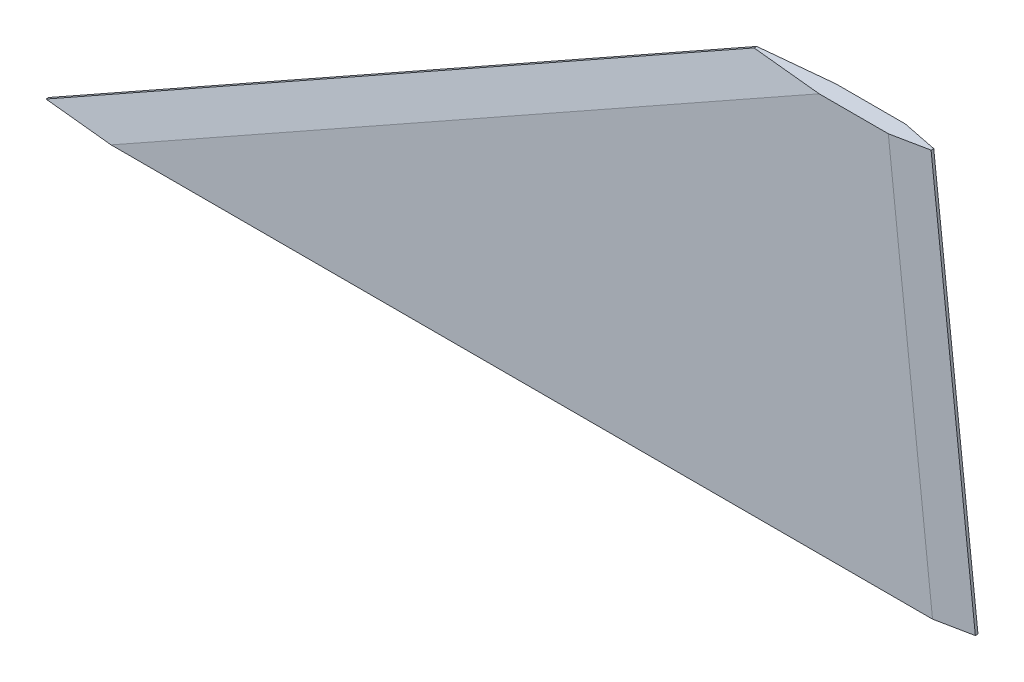
ISO-10303-21;
HEADER;
FILE_DESCRIPTION(('STEP AP214'),'2;1');
FILE_NAME('part.step','',(''),(''),'','','');
FILE_SCHEMA(('AUTOMOTIVE_DESIGN { 1 0 10303 214 1 1 1 1 }'));
ENDSEC;
DATA;
#1=APPLICATION_CONTEXT('core data for automotive mechanical design processes');
#2=APPLICATION_PROTOCOL_DEFINITION('international standard','automotive_design',2000,#1);
#3=PRODUCT_CONTEXT('',#1,'mechanical');
#4=PRODUCT('Part','Part','',(#3));
#5=PRODUCT_RELATED_PRODUCT_CATEGORY('part','',(#4));
#6=PRODUCT_DEFINITION_FORMATION('','',#4);
#7=PRODUCT_DEFINITION_CONTEXT('part definition',#1,'design');
#8=PRODUCT_DEFINITION('design','',#6,#7);
#9=PRODUCT_DEFINITION_SHAPE('','',#8);
#10=(LENGTH_UNIT() NAMED_UNIT(*) SI_UNIT(.MILLI.,.METRE.));
#11=(NAMED_UNIT(*) PLANE_ANGLE_UNIT() SI_UNIT($,.RADIAN.));
#12=(NAMED_UNIT(*) SI_UNIT($,.STERADIAN.) SOLID_ANGLE_UNIT());
#13=UNCERTAINTY_MEASURE_WITH_UNIT(LENGTH_MEASURE(1.E-05),#10,'distance_accuracy_value','');
#14=(GEOMETRIC_REPRESENTATION_CONTEXT(3) GLOBAL_UNCERTAINTY_ASSIGNED_CONTEXT((#13)) GLOBAL_UNIT_ASSIGNED_CONTEXT((#10,
#11,#12)) REPRESENTATION_CONTEXT('',''));
#15=CARTESIAN_POINT('',(0.,0.,0.));
#16=DIRECTION('',(0.,0.,1.));
#17=DIRECTION('',(1.,0.,0.));
#18=AXIS2_PLACEMENT_3D('',#15,#16,#17);
#19=CARTESIAN_POINT('',(133.35,0.,1.2192));
#20=DIRECTION('',(0.,1.,0.));
#21=DIRECTION('',(0.,0.,1.));
#22=AXIS2_PLACEMENT_3D('',#19,#20,#21);
#23=PLANE('',#22);
#24=DIRECTION('',(0.,0.,-1.));
#25=VECTOR('',#24,1.);
#26=CARTESIAN_POINT('',(133.35,0.,1.2192));
#27=LINE('',#26,#25);
#28=CARTESIAN_POINT('',(133.35,0.,0.190499999999965));
#29=VERTEX_POINT('',#28);
#30=CARTESIAN_POINT('',(133.35,0.,-0.190499999999997));
#31=VERTEX_POINT('',#30);
#32=EDGE_CURVE('E130',#29,#31,#27,.T.);
#33=ORIENTED_EDGE('',*,*,#32,.F.);
#34=DIRECTION('',(-0.98034213572889,0.,0.197305085881025));
#35=VECTOR('',#34,1.);
#36=CARTESIAN_POINT('',(126.735732139005,0.,1.5216971818731));
#37=LINE('',#36,#35);
#38=CARTESIAN_POINT('',(128.238738166474,0.,1.2192));
#39=VERTEX_POINT('',#38);
#40=EDGE_CURVE('E51',#29,#39,#37,.T.);
#41=ORIENTED_EDGE('',*,*,#40,.T.);
#42=DIRECTION('',(1.,0.,0.));
#43=VECTOR('',#42,1.);
#44=CARTESIAN_POINT('',(133.35,0.,1.2192));
#45=LINE('',#44,#43);
#46=CARTESIAN_POINT('',(10.3618226148316,0.,1.2192));
#47=VERTEX_POINT('',#46);
#48=EDGE_CURVE('E125',#47,#39,#45,.T.);
#49=ORIENTED_EDGE('',*,*,#48,.F.);
#50=DIRECTION('',(-0.995108081066188,0.,-0.0987922415818602));
#51=VECTOR('',#50,1.);
#52=CARTESIAN_POINT('',(2.56735020952827,0.,0.445381139999556));
#53=LINE('',#52,#51);
#54=CARTESIAN_POINT('',(0.,0.,0.190499999999964));
#55=VERTEX_POINT('',#54);
#56=EDGE_CURVE('E109',#47,#55,#53,.T.);
#57=ORIENTED_EDGE('',*,*,#56,.T.);
#58=DIRECTION('',(0.,0.,-1.));
#59=VECTOR('',#58,1.);
#60=CARTESIAN_POINT('',(0.,0.,1.2192));
#61=LINE('',#60,#59);
#62=CARTESIAN_POINT('',(0.,0.,-0.190500000000007));
#63=VERTEX_POINT('',#62);
#64=EDGE_CURVE('E135',#55,#63,#61,.T.);
#65=ORIENTED_EDGE('',*,*,#64,.T.);
#66=DIRECTION('',(-0.995108081066189,0.,0.0987922415818555));
#67=VECTOR('',#66,1.);
#68=CARTESIAN_POINT('',(0.,0.,-0.190500000000007));
#69=LINE('',#68,#67);
#70=CARTESIAN_POINT('',(10.3618226148317,0.,-1.2192));
#71=VERTEX_POINT('',#70);
#72=EDGE_CURVE('E119',#63,#71,#69,.F.);
#73=ORIENTED_EDGE('',*,*,#72,.T.);
#74=DIRECTION('',(1.,0.,0.));
#75=VECTOR('',#74,1.);
#76=CARTESIAN_POINT('',(133.35,0.,-1.2192));
#77=LINE('',#76,#75);
#78=CARTESIAN_POINT('',(128.238738166473,0.,-1.2192));
#79=VERTEX_POINT('',#78);
#80=EDGE_CURVE('E137',#71,#79,#77,.T.);
#81=ORIENTED_EDGE('',*,*,#80,.T.);
#82=DIRECTION('',(-0.980342135728892,0.,-0.197305085881014));
#83=VECTOR('',#82,1.);
#84=CARTESIAN_POINT('',(127.247201035407,0.,-1.41875820694556));
#85=LINE('',#84,#83);
#86=EDGE_CURVE('E63',#79,#31,#85,.F.);
#87=ORIENTED_EDGE('',*,*,#86,.T.);
#88=EDGE_LOOP('',(#33,#41,#49,#57,#65,#73,#81,#87));
#89=FACE_BOUND('',#88,.T.);
#90=ADVANCED_FACE('F42',(#89),#23,.F.);
#91=CARTESIAN_POINT('',(127.,57.15,1.2192));
#92=DIRECTION('',(-0.993883734673619,-0.110431526074846,0.));
#93=DIRECTION('',(0.110431526074846,-0.993883734673619,0.));
#94=AXIS2_PLACEMENT_3D('',#91,#92,#93);
#95=PLANE('',#94);
#96=DIRECTION('',(0.,0.,-1.));
#97=VECTOR('',#96,1.);
#98=CARTESIAN_POINT('',(127.,57.15,1.2192));
#99=LINE('',#98,#97);
#100=CARTESIAN_POINT('',(127.,57.15,0.190499999999965));
#101=VERTEX_POINT('',#100);
#102=CARTESIAN_POINT('',(127.,57.15,-0.190499999999997));
#103=VERTEX_POINT('',#102);
#104=EDGE_CURVE('E145',#101,#103,#99,.T.);
#105=ORIENTED_EDGE('',*,*,#104,.F.);
#106=DIRECTION('',(0.110431526074846,-0.993883734673619,0.));
#107=VECTOR('',#106,1.);
#108=CARTESIAN_POINT('',(133.35,0.,0.190499999999965));
#109=LINE('',#108,#107);
#110=EDGE_CURVE('E169',#101,#29,#109,.T.);
#111=ORIENTED_EDGE('',*,*,#110,.T.);
#112=ORIENTED_EDGE('',*,*,#32,.T.);
#113=DIRECTION('',(-0.110431526074846,0.993883734673619,0.));
#114=VECTOR('',#113,1.);
#115=CARTESIAN_POINT('',(127.,57.15,-0.190499999999997));
#116=LINE('',#115,#114);
#117=EDGE_CURVE('E166',#31,#103,#116,.T.);
#118=ORIENTED_EDGE('',*,*,#117,.T.);
#119=EDGE_LOOP('',(#105,#111,#112,#118));
#120=FACE_BOUND('',#119,.T.);
#121=ADVANCED_FACE('F174',(#120),#95,.F.);
#122=CARTESIAN_POINT('',(101.6,57.15,1.2192));
#123=DIRECTION('',(0.,-1.,0.));
#124=DIRECTION('',(0.,0.,-1.));
#125=AXIS2_PLACEMENT_3D('',#122,#123,#124);
#126=PLANE('',#125);
#127=DIRECTION('',(-1.,0.,0.));
#128=VECTOR('',#127,1.);
#129=CARTESIAN_POINT('',(101.6,57.15,1.2192));
#130=LINE('',#129,#128);
#131=CARTESIAN_POINT('',(121.888738166474,57.15,1.2192));
#132=VERTEX_POINT('',#131);
#133=CARTESIAN_POINT('',(111.961822614832,57.15,1.2192));
#134=VERTEX_POINT('',#133);
#135=EDGE_CURVE('E128',#132,#134,#130,.T.);
#136=ORIENTED_EDGE('',*,*,#135,.F.);
#137=DIRECTION('',(0.98034213572889,0.,-0.197305085881025));
#138=VECTOR('',#137,1.);
#139=CARTESIAN_POINT('',(126.488531103597,57.15,0.293438974927473));
#140=LINE('',#139,#138);
#141=EDGE_CURVE('E164',#132,#101,#140,.T.);
#142=ORIENTED_EDGE('',*,*,#141,.T.);
#143=ORIENTED_EDGE('',*,*,#104,.T.);
#144=DIRECTION('',(0.980342135728892,0.,0.197305085881014));
#145=VECTOR('',#144,1.);
#146=CARTESIAN_POINT('',(127.,57.15,-0.190499999999997));
#147=LINE('',#146,#145);
#148=CARTESIAN_POINT('',(121.888738166473,57.15,-1.2192));
#149=VERTEX_POINT('',#148);
#150=EDGE_CURVE('E162',#103,#149,#147,.F.);
#151=ORIENTED_EDGE('',*,*,#150,.T.);
#152=DIRECTION('',(-1.,0.,0.));
#153=VECTOR('',#152,1.);
#154=CARTESIAN_POINT('',(101.6,57.15,-1.2192));
#155=LINE('',#154,#153);
#156=CARTESIAN_POINT('',(111.961822614832,57.15,-1.2192));
#157=VERTEX_POINT('',#156);
#158=EDGE_CURVE('E133',#149,#157,#155,.T.);
#159=ORIENTED_EDGE('',*,*,#158,.T.);
#160=DIRECTION('',(0.995108081066189,0.,-0.0987922415818555));
#161=VECTOR('',#160,1.);
#162=CARTESIAN_POINT('',(0.991606550871599,57.15,9.79769012718635));
#163=LINE('',#162,#161);
#164=CARTESIAN_POINT('',(101.6,57.15,-0.190500000000007));
#165=VERTEX_POINT('',#164);
#166=EDGE_CURVE('E153',#157,#165,#163,.F.);
#167=ORIENTED_EDGE('',*,*,#166,.T.);
#168=DIRECTION('',(0.,0.,-1.));
#169=VECTOR('',#168,1.);
#170=CARTESIAN_POINT('',(101.6,57.15,1.2192));
#171=LINE('',#170,#169);
#172=CARTESIAN_POINT('',(101.6,57.15,0.190499999999964));
#173=VERTEX_POINT('',#172);
#174=EDGE_CURVE('E142',#173,#165,#171,.T.);
#175=ORIENTED_EDGE('',*,*,#174,.F.);
#176=DIRECTION('',(0.995108081066188,0.,0.0987922415818602));
#177=VECTOR('',#176,1.);
#178=CARTESIAN_POINT('',(3.55895676039996,57.15,-9.54280898718727));
#179=LINE('',#178,#177);
#180=EDGE_CURVE('E155',#173,#134,#179,.T.);
#181=ORIENTED_EDGE('',*,*,#180,.T.);
#182=EDGE_LOOP('',(#136,#142,#143,#151,#159,#167,#175,#181));
#183=FACE_BOUND('',#182,.T.);
#184=ADVANCED_FACE('F179',(#183),#126,.F.);
#185=CARTESIAN_POINT('',(0.,0.,1.2192));
#186=DIRECTION('',(0.490261239632559,-0.871575537124549,0.));
#187=DIRECTION('',(0.871575537124549,0.490261239632559,0.));
#188=AXIS2_PLACEMENT_3D('',#185,#186,#187);
#189=PLANE('',#188);
#190=ORIENTED_EDGE('',*,*,#64,.F.);
#191=DIRECTION('',(0.871575537124549,0.490261239632559,0.));
#192=VECTOR('',#191,1.);
#193=CARTESIAN_POINT('',(101.6,57.15,0.190499999999964));
#194=LINE('',#193,#192);
#195=EDGE_CURVE('E114',#55,#173,#194,.T.);
#196=ORIENTED_EDGE('',*,*,#195,.T.);
#197=ORIENTED_EDGE('',*,*,#174,.T.);
#198=DIRECTION('',(-0.871575537124549,-0.490261239632559,0.));
#199=VECTOR('',#198,1.);
#200=CARTESIAN_POINT('',(0.,0.,-0.190500000000007));
#201=LINE('',#200,#199);
#202=EDGE_CURVE('E118',#165,#63,#201,.T.);
#203=ORIENTED_EDGE('',*,*,#202,.T.);
#204=EDGE_LOOP('',(#190,#196,#197,#203));
#205=FACE_BOUND('',#204,.T.);
#206=ADVANCED_FACE('F184',(#205),#189,.F.);
#207=CARTESIAN_POINT('',(0.,0.,1.2192));
#208=DIRECTION('',(0.,0.,1.));
#209=DIRECTION('',(1.,0.,0.));
#210=AXIS2_PLACEMENT_3D('',#207,#208,#209);
#211=PLANE('',#210);
#212=ORIENTED_EDGE('',*,*,#48,.T.);
#213=DIRECTION('',(-0.110431526074846,0.993883734673619,0.));
#214=VECTOR('',#213,1.);
#215=CARTESIAN_POINT('',(121.951070627858,56.5890078475398,1.2192));
#216=LINE('',#215,#214);
#217=EDGE_CURVE('E160',#39,#132,#216,.T.);
#218=ORIENTED_EDGE('',*,*,#217,.T.);
#219=ORIENTED_EDGE('',*,*,#135,.T.);
#220=DIRECTION('',(-0.871575537124549,-0.490261239632559,0.));
#221=VECTOR('',#220,1.);
#222=CARTESIAN_POINT('',(2.4905270973334,-4.42760372859272,1.2192));
#223=LINE('',#222,#221);
#224=EDGE_CURVE('E113',#134,#47,#223,.T.);
#225=ORIENTED_EDGE('',*,*,#224,.T.);
#226=EDGE_LOOP('',(#212,#218,#219,#225));
#227=FACE_BOUND('',#226,.T.);
#228=ADVANCED_FACE('F123',(#227),#211,.T.);
#229=CARTESIAN_POINT('',(0.,0.,-1.2192));
#230=DIRECTION('',(0.,0.,1.));
#231=DIRECTION('',(1.,0.,0.));
#232=AXIS2_PLACEMENT_3D('',#229,#230,#231);
#233=PLANE('',#232);
#234=ORIENTED_EDGE('',*,*,#158,.F.);
#235=DIRECTION('',(0.110431526074846,-0.993883734673619,0.));
#236=VECTOR('',#235,1.);
#237=CARTESIAN_POINT('',(126.674851115663,14.0749834572959,-1.2192));
#238=LINE('',#237,#236);
#239=EDGE_CURVE('E11',#149,#79,#238,.T.);
#240=ORIENTED_EDGE('',*,*,#239,.T.);
#241=ORIENTED_EDGE('',*,*,#80,.F.);
#242=DIRECTION('',(0.871575537124549,0.490261239632559,0.));
#243=VECTOR('',#242,1.);
#244=CARTESIAN_POINT('',(2.49052709733343,-4.42760372859276,-1.2192));
#245=LINE('',#244,#243);
#246=EDGE_CURVE('E157',#71,#157,#245,.T.);
#247=ORIENTED_EDGE('',*,*,#246,.T.);
#248=EDGE_LOOP('',(#234,#240,#241,#247));
#249=FACE_BOUND('',#248,.T.);
#250=ADVANCED_FACE('F188',(#249),#233,.F.);
#251=CARTESIAN_POINT('',(2.4905270973334,-4.42760372859272,1.2192));
#252=DIRECTION('',(-0.0973029300181999,0.172982986699022,0.980106640178792));
#253=DIRECTION('',(0.871575537124549,0.490261239632559,0.));
#254=AXIS2_PLACEMENT_3D('',#251,#252,#253);
#255=PLANE('',#254);
#256=ORIENTED_EDGE('',*,*,#180,.F.);
#257=ORIENTED_EDGE('',*,*,#195,.F.);
#258=ORIENTED_EDGE('',*,*,#56,.F.);
#259=ORIENTED_EDGE('',*,*,#224,.F.);
#260=EDGE_LOOP('',(#256,#257,#258,#259));
#261=FACE_BOUND('',#260,.T.);
#262=ADVANCED_FACE('F112',(#261),#255,.T.);
#263=CARTESIAN_POINT('',(0.,0.,-0.190500000000007));
#264=DIRECTION('',(0.0973029300181954,-0.172982986699014,0.980106640178793));
#265=DIRECTION('',(-0.871575537124549,-0.490261239632559,0.));
#266=AXIS2_PLACEMENT_3D('',#263,#264,#265);
#267=PLANE('',#266);
#268=ORIENTED_EDGE('',*,*,#166,.F.);
#269=ORIENTED_EDGE('',*,*,#246,.F.);
#270=ORIENTED_EDGE('',*,*,#72,.F.);
#271=ORIENTED_EDGE('',*,*,#202,.F.);
#272=EDGE_LOOP('',(#268,#269,#270,#271));
#273=FACE_BOUND('',#272,.T.);
#274=ADVANCED_FACE('F186',(#273),#267,.F.);
#275=CARTESIAN_POINT('',(126.674851115663,14.0749834572959,1.2192));
#276=DIRECTION('',(0.197257689703666,0.0219175210781851,0.980106640178792));
#277=DIRECTION('',(0.110431526074846,-0.993883734673619,0.));
#278=AXIS2_PLACEMENT_3D('',#275,#276,#277);
#279=PLANE('',#278);
#280=ORIENTED_EDGE('',*,*,#40,.F.);
#281=ORIENTED_EDGE('',*,*,#110,.F.);
#282=ORIENTED_EDGE('',*,*,#141,.F.);
#283=ORIENTED_EDGE('',*,*,#217,.F.);
#284=EDGE_LOOP('',(#280,#281,#282,#283));
#285=FACE_BOUND('',#284,.T.);
#286=ADVANCED_FACE('F177',(#285),#279,.T.);
#287=CARTESIAN_POINT('',(127.,57.15,-0.190499999999997));
#288=DIRECTION('',(-0.197257689703656,-0.021917521078184,0.980106640178794));
#289=DIRECTION('',(-0.110431526074846,0.993883734673619,0.));
#290=AXIS2_PLACEMENT_3D('',#287,#288,#289);
#291=PLANE('',#290);
#292=ORIENTED_EDGE('',*,*,#86,.F.);
#293=ORIENTED_EDGE('',*,*,#239,.F.);
#294=ORIENTED_EDGE('',*,*,#150,.F.);
#295=ORIENTED_EDGE('',*,*,#117,.F.);
#296=EDGE_LOOP('',(#292,#293,#294,#295));
#297=FACE_BOUND('',#296,.T.);
#298=ADVANCED_FACE('F45',(#297),#291,.F.);
#299=CLOSED_SHELL('',(#90,#121,#184,#206,#228,#250,#262,#274,#286,#298));
#300=MANIFOLD_SOLID_BREP('B2',#299);
#301=ADVANCED_BREP_SHAPE_REPRESENTATION('',(#18,#300),#14);
#302=SHAPE_DEFINITION_REPRESENTATION(#9,#301);
ENDSEC;
END-ISO-10303-21;
